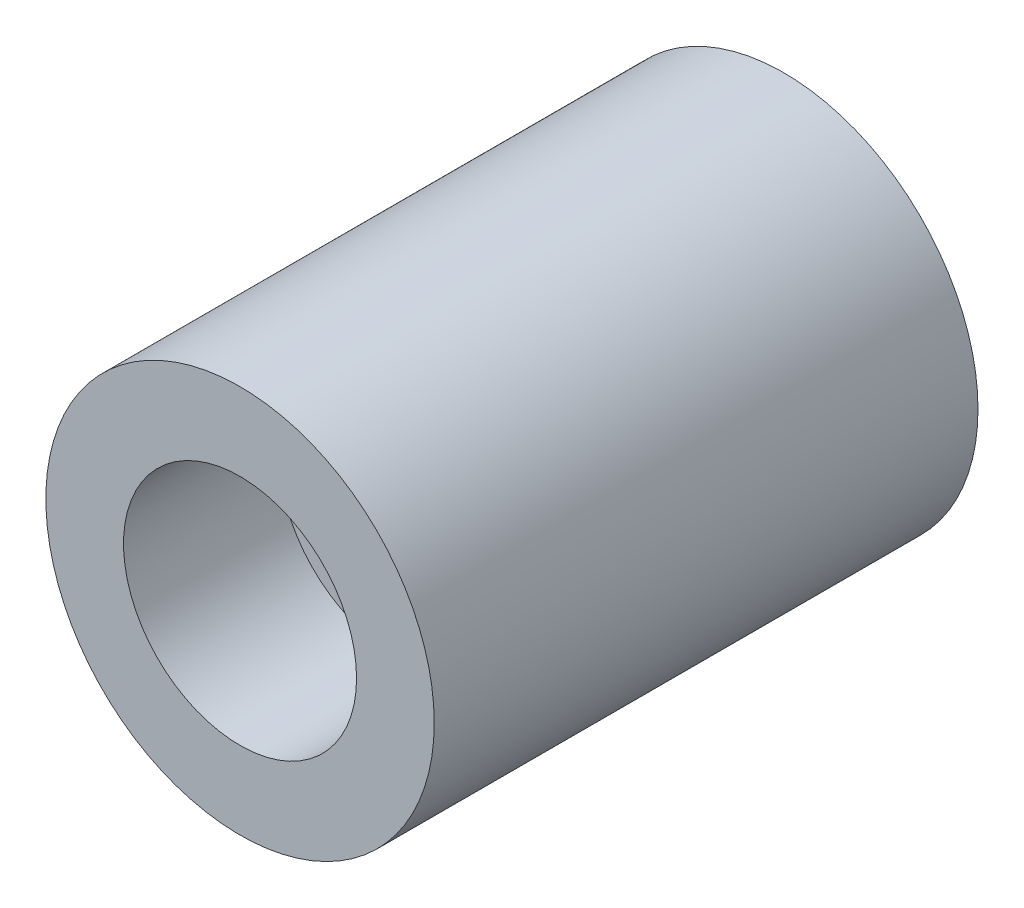
ISO-10303-21;
HEADER;
FILE_DESCRIPTION(('STEP AP214'),'2;1');
FILE_NAME('part.step','',(''),(''),'','','');
FILE_SCHEMA(('AUTOMOTIVE_DESIGN { 1 0 10303 214 1 1 1 1 }'));
ENDSEC;
DATA;
#1=APPLICATION_CONTEXT('core data for automotive mechanical design processes');
#2=APPLICATION_PROTOCOL_DEFINITION('international standard','automotive_design',2000,#1);
#3=PRODUCT_CONTEXT('',#1,'mechanical');
#4=PRODUCT('Part','Part','',(#3));
#5=PRODUCT_RELATED_PRODUCT_CATEGORY('part','',(#4));
#6=PRODUCT_DEFINITION_FORMATION('','',#4);
#7=PRODUCT_DEFINITION_CONTEXT('part definition',#1,'design');
#8=PRODUCT_DEFINITION('design','',#6,#7);
#9=PRODUCT_DEFINITION_SHAPE('','',#8);
#10=(LENGTH_UNIT() NAMED_UNIT(*) SI_UNIT(.MILLI.,.METRE.));
#11=(NAMED_UNIT(*) PLANE_ANGLE_UNIT() SI_UNIT($,.RADIAN.));
#12=(NAMED_UNIT(*) SI_UNIT($,.STERADIAN.) SOLID_ANGLE_UNIT());
#13=UNCERTAINTY_MEASURE_WITH_UNIT(LENGTH_MEASURE(1.E-05),#10,'distance_accuracy_value','');
#14=(GEOMETRIC_REPRESENTATION_CONTEXT(3) GLOBAL_UNCERTAINTY_ASSIGNED_CONTEXT((#13)) GLOBAL_UNIT_ASSIGNED_CONTEXT((#10,
#11,#12)) REPRESENTATION_CONTEXT('',''));
#15=CARTESIAN_POINT('',(0.,0.,0.));
#16=DIRECTION('',(0.,0.,1.));
#17=DIRECTION('',(1.,0.,0.));
#18=AXIS2_PLACEMENT_3D('',#15,#16,#17);
#19=CARTESIAN_POINT('',(0.,0.,140.));
#20=DIRECTION('',(0.,0.,-1.));
#21=DIRECTION('',(-1.,0.,0.));
#22=AXIS2_PLACEMENT_3D('',#19,#20,#21);
#23=CYLINDRICAL_SURFACE('',#22,50.);
#24=CARTESIAN_POINT('',(0.,0.,140.));
#25=DIRECTION('',(0.,0.,1.));
#26=DIRECTION('',(1.,0.,0.));
#27=AXIS2_PLACEMENT_3D('',#24,#25,#26);
#28=CIRCLE('',#27,50.);
#29=CARTESIAN_POINT('',(50.,0.,140.));
#30=VERTEX_POINT('',#29);
#31=EDGE_CURVE('E10',#30,#30,#28,.T.);
#32=ORIENTED_EDGE('',*,*,#31,.F.);
#33=EDGE_LOOP('',(#32));
#34=FACE_BOUND('',#33,.T.);
#35=CARTESIAN_POINT('',(0.,0.,0.));
#36=DIRECTION('',(0.,0.,1.));
#37=DIRECTION('',(1.,0.,0.));
#38=AXIS2_PLACEMENT_3D('',#35,#36,#37);
#39=CIRCLE('',#38,50.);
#40=CARTESIAN_POINT('',(50.,0.,0.));
#41=VERTEX_POINT('',#40);
#42=EDGE_CURVE('E38',#41,#41,#39,.T.);
#43=ORIENTED_EDGE('',*,*,#42,.T.);
#44=EDGE_LOOP('',(#43));
#45=FACE_BOUND('',#44,.T.);
#46=ADVANCED_FACE('F31',(#34,#45),#23,.T.);
#47=CARTESIAN_POINT('',(0.,0.,140.));
#48=DIRECTION('',(0.,0.,1.));
#49=DIRECTION('',(1.,0.,0.));
#50=AXIS2_PLACEMENT_3D('',#47,#48,#49);
#51=PLANE('',#50);
#52=CARTESIAN_POINT('',(0.,0.,140.));
#53=DIRECTION('',(0.,0.,1.));
#54=DIRECTION('',(1.,0.,0.));
#55=AXIS2_PLACEMENT_3D('',#52,#53,#54);
#56=CIRCLE('',#55,30.);
#57=CARTESIAN_POINT('',(30.,0.,140.));
#58=VERTEX_POINT('',#57);
#59=EDGE_CURVE('E45',#58,#58,#56,.T.);
#60=ORIENTED_EDGE('',*,*,#59,.F.);
#61=EDGE_LOOP('',(#60));
#62=FACE_BOUND('',#61,.T.);
#63=ORIENTED_EDGE('',*,*,#31,.T.);
#64=EDGE_LOOP('',(#63));
#65=FACE_BOUND('',#64,.T.);
#66=ADVANCED_FACE('F73',(#62,#65),#51,.T.);
#67=CARTESIAN_POINT('',(0.,0.,0.));
#68=DIRECTION('',(0.,0.,1.));
#69=DIRECTION('',(1.,0.,0.));
#70=AXIS2_PLACEMENT_3D('',#67,#68,#69);
#71=PLANE('',#70);
#72=ORIENTED_EDGE('',*,*,#42,.F.);
#73=EDGE_LOOP('',(#72));
#74=FACE_BOUND('',#73,.T.);
#75=ADVANCED_FACE('F69',(#74),#71,.F.);
#76=CARTESIAN_POINT('',(0.,0.,100.));
#77=DIRECTION('',(0.,0.,1.));
#78=DIRECTION('',(1.,0.,0.));
#79=AXIS2_PLACEMENT_3D('',#76,#77,#78);
#80=CYLINDRICAL_SURFACE('',#79,30.);
#81=CARTESIAN_POINT('',(0.,0.,100.));
#82=DIRECTION('',(0.,0.,1.));
#83=DIRECTION('',(1.,0.,0.));
#84=AXIS2_PLACEMENT_3D('',#81,#82,#83);
#85=CIRCLE('',#84,30.);
#86=CARTESIAN_POINT('',(30.,0.,100.));
#87=VERTEX_POINT('',#86);
#88=EDGE_CURVE('E43',#87,#87,#85,.T.);
#89=ORIENTED_EDGE('',*,*,#88,.F.);
#90=EDGE_LOOP('',(#89));
#91=FACE_BOUND('',#90,.T.);
#92=ORIENTED_EDGE('',*,*,#59,.T.);
#93=EDGE_LOOP('',(#92));
#94=FACE_BOUND('',#93,.T.);
#95=ADVANCED_FACE('F63',(#91,#94),#80,.F.);
#96=CARTESIAN_POINT('',(0.,0.,100.));
#97=DIRECTION('',(0.,0.,1.));
#98=DIRECTION('',(1.,0.,0.));
#99=AXIS2_PLACEMENT_3D('',#96,#97,#98);
#100=PLANE('',#99);
#101=CARTESIAN_POINT('',(0.,0.,100.));
#102=DIRECTION('',(0.,0.,1.));
#103=DIRECTION('',(1.,0.,0.));
#104=AXIS2_PLACEMENT_3D('',#101,#102,#103);
#105=CIRCLE('',#104,9.99999999999999);
#106=CARTESIAN_POINT('',(9.99999999999999,0.,100.));
#107=VERTEX_POINT('',#106);
#108=EDGE_CURVE('E34',#107,#107,#105,.T.);
#109=ORIENTED_EDGE('',*,*,#108,.F.);
#110=EDGE_LOOP('',(#109));
#111=FACE_BOUND('',#110,.T.);
#112=ORIENTED_EDGE('',*,*,#88,.T.);
#113=EDGE_LOOP('',(#112));
#114=FACE_BOUND('',#113,.T.);
#115=ADVANCED_FACE('F60',(#111,#114),#100,.T.);
#116=CARTESIAN_POINT('',(0.,0.,20.));
#117=DIRECTION('',(0.,0.,1.));
#118=DIRECTION('',(1.,0.,0.));
#119=AXIS2_PLACEMENT_3D('',#116,#117,#118);
#120=CYLINDRICAL_SURFACE('',#119,9.99999999999999);
#121=ORIENTED_EDGE('',*,*,#108,.T.);
#122=EDGE_LOOP('',(#121));
#123=FACE_BOUND('',#122,.T.);
#124=CARTESIAN_POINT('',(0.,0.,20.));
#125=DIRECTION('',(0.,0.,1.));
#126=DIRECTION('',(1.,0.,0.));
#127=AXIS2_PLACEMENT_3D('',#124,#125,#126);
#128=CIRCLE('',#127,9.99999999999999);
#129=CARTESIAN_POINT('',(9.99999999999999,0.,20.));
#130=VERTEX_POINT('',#129);
#131=EDGE_CURVE('E50',#130,#130,#128,.T.);
#132=ORIENTED_EDGE('',*,*,#131,.F.);
#133=EDGE_LOOP('',(#132));
#134=FACE_BOUND('',#133,.T.);
#135=ADVANCED_FACE('F57',(#123,#134),#120,.F.);
#136=CARTESIAN_POINT('',(0.,0.,20.));
#137=DIRECTION('',(0.,0.,1.));
#138=DIRECTION('',(1.,0.,0.));
#139=AXIS2_PLACEMENT_3D('',#136,#137,#138);
#140=PLANE('',#139);
#141=ORIENTED_EDGE('',*,*,#131,.T.);
#142=EDGE_LOOP('',(#141));
#143=FACE_BOUND('',#142,.T.);
#144=ADVANCED_FACE('F85',(#143),#140,.T.);
#145=CLOSED_SHELL('',(#46,#66,#75,#95,#115,#135,#144));
#146=MANIFOLD_SOLID_BREP('B2',#145);
#147=ADVANCED_BREP_SHAPE_REPRESENTATION('',(#18,#146),#14);
#148=SHAPE_DEFINITION_REPRESENTATION(#9,#147);
ENDSEC;
END-ISO-10303-21;
